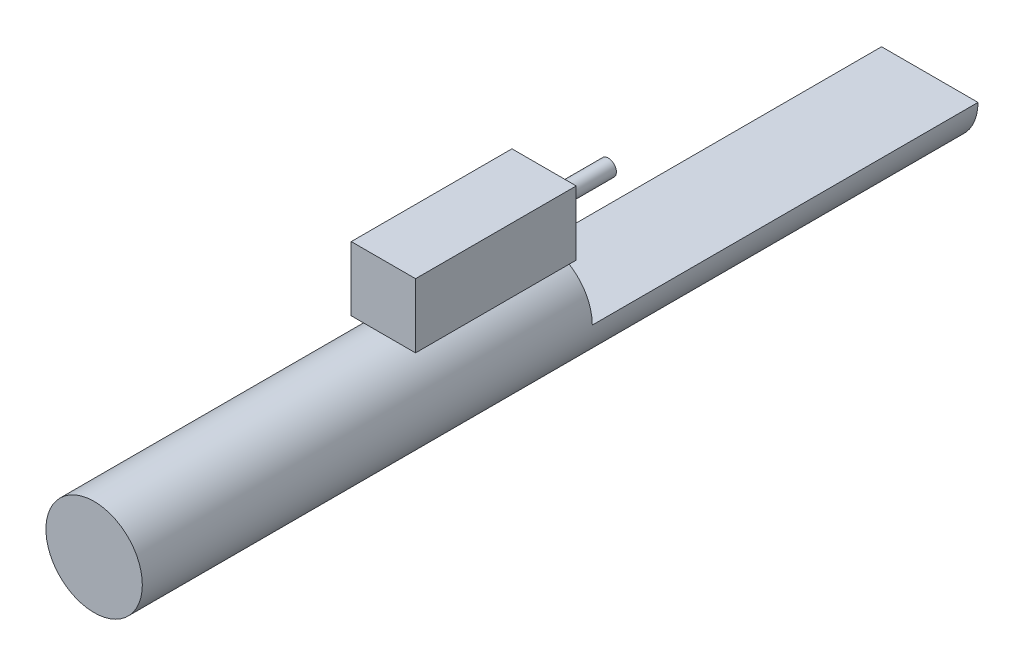
ISO-10303-21;
HEADER;
FILE_DESCRIPTION(('STEP AP214'),'2;1');
FILE_NAME('part.step','',(''),(''),'','','');
FILE_SCHEMA(('AUTOMOTIVE_DESIGN { 1 0 10303 214 1 1 1 1 }'));
ENDSEC;
DATA;
#1=APPLICATION_CONTEXT('core data for automotive mechanical design processes');
#2=APPLICATION_PROTOCOL_DEFINITION('international standard','automotive_design',2000,#1);
#3=PRODUCT_CONTEXT('',#1,'mechanical');
#4=PRODUCT('Part','Part','',(#3));
#5=PRODUCT_RELATED_PRODUCT_CATEGORY('part','',(#4));
#6=PRODUCT_DEFINITION_FORMATION('','',#4);
#7=PRODUCT_DEFINITION_CONTEXT('part definition',#1,'design');
#8=PRODUCT_DEFINITION('design','',#6,#7);
#9=PRODUCT_DEFINITION_SHAPE('','',#8);
#10=(LENGTH_UNIT() NAMED_UNIT(*) SI_UNIT(.MILLI.,.METRE.));
#11=(NAMED_UNIT(*) PLANE_ANGLE_UNIT() SI_UNIT($,.RADIAN.));
#12=(NAMED_UNIT(*) SI_UNIT($,.STERADIAN.) SOLID_ANGLE_UNIT());
#13=UNCERTAINTY_MEASURE_WITH_UNIT(LENGTH_MEASURE(1.E-05),#10,'distance_accuracy_value','');
#14=(GEOMETRIC_REPRESENTATION_CONTEXT(3) GLOBAL_UNCERTAINTY_ASSIGNED_CONTEXT((#13)) GLOBAL_UNIT_ASSIGNED_CONTEXT((#10,
#11,#12)) REPRESENTATION_CONTEXT('',''));
#15=CARTESIAN_POINT('',(0.,0.,0.));
#16=DIRECTION('',(0.,0.,1.));
#17=DIRECTION('',(1.,0.,0.));
#18=AXIS2_PLACEMENT_3D('',#15,#16,#17);
#19=CARTESIAN_POINT('',(-5.,17.5,0.));
#20=DIRECTION('',(1.,0.,0.));
#21=DIRECTION('',(0.,0.,-1.));
#22=AXIS2_PLACEMENT_3D('',#19,#20,#21);
#23=PLANE('',#22);
#24=DIRECTION('',(0.,0.,1.));
#25=VECTOR('',#24,1.);
#26=CARTESIAN_POINT('',(-5.,7.5,0.));
#27=LINE('',#26,#25);
#28=CARTESIAN_POINT('',(-5.,7.5,0.));
#29=VERTEX_POINT('',#28);
#30=CARTESIAN_POINT('',(-5.,7.5,25.));
#31=VERTEX_POINT('',#30);
#32=EDGE_CURVE('E115',#29,#31,#27,.T.);
#33=ORIENTED_EDGE('',*,*,#32,.T.);
#34=DIRECTION('',(0.,-1.,0.));
#35=VECTOR('',#34,1.);
#36=CARTESIAN_POINT('',(-5.,17.5,25.));
#37=LINE('',#36,#35);
#38=CARTESIAN_POINT('',(-5.,17.5,25.));
#39=VERTEX_POINT('',#38);
#40=EDGE_CURVE('E52',#39,#31,#37,.T.);
#41=ORIENTED_EDGE('',*,*,#40,.F.);
#42=DIRECTION('',(0.,0.,1.));
#43=VECTOR('',#42,1.);
#44=CARTESIAN_POINT('',(-5.,17.5,0.));
#45=LINE('',#44,#43);
#46=CARTESIAN_POINT('',(-5.,17.5,0.));
#47=VERTEX_POINT('',#46);
#48=EDGE_CURVE('E102',#47,#39,#45,.T.);
#49=ORIENTED_EDGE('',*,*,#48,.F.);
#50=DIRECTION('',(0.,-1.,0.));
#51=VECTOR('',#50,1.);
#52=CARTESIAN_POINT('',(-5.,17.5,0.));
#53=LINE('',#52,#51);
#54=EDGE_CURVE('E111',#47,#29,#53,.T.);
#55=ORIENTED_EDGE('',*,*,#54,.T.);
#56=EDGE_LOOP('',(#33,#41,#49,#55));
#57=FACE_BOUND('',#56,.T.);
#58=ADVANCED_FACE('F49',(#57),#23,.F.);
#59=CARTESIAN_POINT('',(-5.,17.5,25.));
#60=DIRECTION('',(0.,0.,-1.));
#61=DIRECTION('',(-1.,0.,0.));
#62=AXIS2_PLACEMENT_3D('',#59,#60,#61);
#63=PLANE('',#62);
#64=DIRECTION('',(1.,0.,0.));
#65=VECTOR('',#64,1.);
#66=CARTESIAN_POINT('',(-5.,7.5,25.));
#67=LINE('',#66,#65);
#68=CARTESIAN_POINT('',(5.,7.5,25.));
#69=VERTEX_POINT('',#68);
#70=EDGE_CURVE('E107',#31,#69,#67,.T.);
#71=ORIENTED_EDGE('',*,*,#70,.T.);
#72=DIRECTION('',(0.,-1.,0.));
#73=VECTOR('',#72,1.);
#74=CARTESIAN_POINT('',(5.,17.5,25.));
#75=LINE('',#74,#73);
#76=CARTESIAN_POINT('',(5.,17.5,25.));
#77=VERTEX_POINT('',#76);
#78=EDGE_CURVE('E105',#77,#69,#75,.T.);
#79=ORIENTED_EDGE('',*,*,#78,.F.);
#80=DIRECTION('',(1.,0.,0.));
#81=VECTOR('',#80,1.);
#82=CARTESIAN_POINT('',(-5.,17.5,25.));
#83=LINE('',#82,#81);
#84=EDGE_CURVE('E97',#39,#77,#83,.T.);
#85=ORIENTED_EDGE('',*,*,#84,.F.);
#86=ORIENTED_EDGE('',*,*,#40,.T.);
#87=EDGE_LOOP('',(#71,#79,#85,#86));
#88=FACE_BOUND('',#87,.T.);
#89=ADVANCED_FACE('F106',(#88),#63,.F.);
#90=CARTESIAN_POINT('',(5.,17.5,0.));
#91=DIRECTION('',(-1.,0.,0.));
#92=DIRECTION('',(0.,0.,1.));
#93=AXIS2_PLACEMENT_3D('',#90,#91,#92);
#94=PLANE('',#93);
#95=DIRECTION('',(0.,0.,-1.));
#96=VECTOR('',#95,1.);
#97=CARTESIAN_POINT('',(5.,7.5,0.));
#98=LINE('',#97,#96);
#99=CARTESIAN_POINT('',(5.,7.5,0.));
#100=VERTEX_POINT('',#99);
#101=EDGE_CURVE('E83',#69,#100,#98,.T.);
#102=ORIENTED_EDGE('',*,*,#101,.T.);
#103=DIRECTION('',(0.,-1.,0.));
#104=VECTOR('',#103,1.);
#105=CARTESIAN_POINT('',(5.,17.5,0.));
#106=LINE('',#105,#104);
#107=CARTESIAN_POINT('',(5.,17.5,0.));
#108=VERTEX_POINT('',#107);
#109=EDGE_CURVE('E108',#108,#100,#106,.T.);
#110=ORIENTED_EDGE('',*,*,#109,.F.);
#111=DIRECTION('',(0.,0.,-1.));
#112=VECTOR('',#111,1.);
#113=CARTESIAN_POINT('',(5.,17.5,0.));
#114=LINE('',#113,#112);
#115=EDGE_CURVE('E100',#77,#108,#114,.T.);
#116=ORIENTED_EDGE('',*,*,#115,.F.);
#117=ORIENTED_EDGE('',*,*,#78,.T.);
#118=EDGE_LOOP('',(#102,#110,#116,#117));
#119=FACE_BOUND('',#118,.T.);
#120=ADVANCED_FACE('F109',(#119),#94,.F.);
#121=CARTESIAN_POINT('',(-5.,17.5,0.));
#122=DIRECTION('',(0.,0.,1.));
#123=DIRECTION('',(1.,0.,0.));
#124=AXIS2_PLACEMENT_3D('',#121,#122,#123);
#125=PLANE('',#124);
#126=CARTESIAN_POINT('',(0.,12.5,0.));
#127=DIRECTION('',(0.,0.,-1.));
#128=DIRECTION('',(-1.,0.,0.));
#129=AXIS2_PLACEMENT_3D('',#126,#127,#128);
#130=CIRCLE('',#129,1.25);
#131=CARTESIAN_POINT('',(-1.25,12.5,0.));
#132=VERTEX_POINT('',#131);
#133=EDGE_CURVE('E12',#132,#132,#130,.T.);
#134=ORIENTED_EDGE('',*,*,#133,.F.);
#135=EDGE_LOOP('',(#134));
#136=FACE_BOUND('',#135,.T.);
#137=DIRECTION('',(-1.,0.,0.));
#138=VECTOR('',#137,1.);
#139=CARTESIAN_POINT('',(-5.,7.5,0.));
#140=LINE('',#139,#138);
#141=EDGE_CURVE('E89',#100,#29,#140,.T.);
#142=ORIENTED_EDGE('',*,*,#141,.T.);
#143=ORIENTED_EDGE('',*,*,#54,.F.);
#144=DIRECTION('',(-1.,0.,0.));
#145=VECTOR('',#144,1.);
#146=CARTESIAN_POINT('',(-5.,17.5,0.));
#147=LINE('',#146,#145);
#148=EDGE_CURVE('E66',#108,#47,#147,.T.);
#149=ORIENTED_EDGE('',*,*,#148,.F.);
#150=ORIENTED_EDGE('',*,*,#109,.T.);
#151=EDGE_LOOP('',(#142,#143,#149,#150));
#152=FACE_BOUND('',#151,.T.);
#153=ADVANCED_FACE('F123',(#136,#152),#125,.F.);
#154=CARTESIAN_POINT('',(0.,17.5,0.));
#155=DIRECTION('',(0.,1.,0.));
#156=DIRECTION('',(0.,0.,1.));
#157=AXIS2_PLACEMENT_3D('',#154,#155,#156);
#158=PLANE('',#157);
#159=ORIENTED_EDGE('',*,*,#48,.T.);
#160=ORIENTED_EDGE('',*,*,#84,.T.);
#161=ORIENTED_EDGE('',*,*,#115,.T.);
#162=ORIENTED_EDGE('',*,*,#148,.T.);
#163=EDGE_LOOP('',(#159,#160,#161,#162));
#164=FACE_BOUND('',#163,.T.);
#165=ADVANCED_FACE('F98',(#164),#158,.T.);
#166=CARTESIAN_POINT('',(0.,7.5,0.));
#167=DIRECTION('',(0.,1.,0.));
#168=DIRECTION('',(0.,0.,1.));
#169=AXIS2_PLACEMENT_3D('',#166,#167,#168);
#170=PLANE('',#169);
#171=ORIENTED_EDGE('',*,*,#32,.F.);
#172=ORIENTED_EDGE('',*,*,#141,.F.);
#173=ORIENTED_EDGE('',*,*,#101,.F.);
#174=ORIENTED_EDGE('',*,*,#70,.F.);
#175=EDGE_LOOP('',(#171,#172,#173,#174));
#176=FACE_BOUND('',#175,.T.);
#177=ADVANCED_FACE('F126',(#176),#170,.F.);
#178=CARTESIAN_POINT('',(0.,12.5,-10.));
#179=DIRECTION('',(0.,0.,1.));
#180=DIRECTION('',(1.,0.,0.));
#181=AXIS2_PLACEMENT_3D('',#178,#179,#180);
#182=CYLINDRICAL_SURFACE('',#181,1.25);
#183=CARTESIAN_POINT('',(0.,12.5,-10.));
#184=DIRECTION('',(0.,0.,-1.));
#185=DIRECTION('',(-1.,0.,0.));
#186=AXIS2_PLACEMENT_3D('',#183,#184,#185);
#187=CIRCLE('',#186,1.25);
#188=CARTESIAN_POINT('',(-1.25,12.5,-10.));
#189=VERTEX_POINT('',#188);
#190=EDGE_CURVE('E118',#189,#189,#187,.T.);
#191=ORIENTED_EDGE('',*,*,#190,.F.);
#192=EDGE_LOOP('',(#191));
#193=FACE_BOUND('',#192,.T.);
#194=ORIENTED_EDGE('',*,*,#133,.T.);
#195=EDGE_LOOP('',(#194));
#196=FACE_BOUND('',#195,.T.);
#197=ADVANCED_FACE('F134',(#193,#196),#182,.T.);
#198=CARTESIAN_POINT('',(0.,12.5,-10.));
#199=DIRECTION('',(0.,0.,-1.));
#200=DIRECTION('',(-1.,0.,0.));
#201=AXIS2_PLACEMENT_3D('',#198,#199,#200);
#202=PLANE('',#201);
#203=ORIENTED_EDGE('',*,*,#190,.T.);
#204=EDGE_LOOP('',(#203));
#205=FACE_BOUND('',#204,.T.);
#206=ADVANCED_FACE('F132',(#205),#202,.T.);
#207=CLOSED_SHELL('',(#58,#89,#120,#153,#165,#177,#197,#206));
#208=MANIFOLD_SOLID_BREP('B2',#207);
#209=CARTESIAN_POINT('',(0.,0.,0.));
#210=DIRECTION('',(0.,0.,1.));
#211=DIRECTION('',(1.,0.,0.));
#212=AXIS2_PLACEMENT_3D('',#209,#210,#211);
#213=PLANE('',#212);
#214=DIRECTION('',(1.,0.,0.));
#215=VECTOR('',#214,1.);
#216=CARTESIAN_POINT('',(7.5,0.,0.));
#217=LINE('',#216,#215);
#218=CARTESIAN_POINT('',(-7.5,0.,0.));
#219=VERTEX_POINT('',#218);
#220=CARTESIAN_POINT('',(7.5,0.,0.));
#221=VERTEX_POINT('',#220);
#222=EDGE_CURVE('E217',#219,#221,#217,.T.);
#223=ORIENTED_EDGE('',*,*,#222,.F.);
#224=CARTESIAN_POINT('',(0.,0.,0.));
#225=DIRECTION('',(0.,0.,1.));
#226=DIRECTION('',(1.,0.,0.));
#227=AXIS2_PLACEMENT_3D('',#224,#225,#226);
#228=CIRCLE('',#227,7.5);
#229=EDGE_CURVE('E206',#221,#219,#228,.T.);
#230=ORIENTED_EDGE('',*,*,#229,.F.);
#231=EDGE_LOOP('',(#223,#230));
#232=FACE_BOUND('',#231,.T.);
#233=ADVANCED_FACE('F202',(#232),#213,.F.);
#234=CARTESIAN_POINT('',(0.,0.,70.));
#235=DIRECTION('',(0.,0.,-1.));
#236=DIRECTION('',(-1.,0.,0.));
#237=AXIS2_PLACEMENT_3D('',#234,#235,#236);
#238=CYLINDRICAL_SURFACE('',#237,7.5);
#239=CARTESIAN_POINT('',(0.,0.,70.));
#240=DIRECTION('',(0.,0.,1.));
#241=DIRECTION('',(1.,0.,0.));
#242=AXIS2_PLACEMENT_3D('',#239,#240,#241);
#243=CIRCLE('',#242,7.5);
#244=CARTESIAN_POINT('',(7.5,0.,70.));
#245=VERTEX_POINT('',#244);
#246=EDGE_CURVE('E47',#245,#245,#243,.T.);
#247=ORIENTED_EDGE('',*,*,#246,.F.);
#248=EDGE_LOOP('',(#247));
#249=FACE_BOUND('',#248,.T.);
#250=ORIENTED_EDGE('',*,*,#229,.T.);
#251=DIRECTION('',(0.,0.,1.));
#252=VECTOR('',#251,1.);
#253=CARTESIAN_POINT('',(-7.5,0.,-60.));
#254=LINE('',#253,#252);
#255=CARTESIAN_POINT('',(-7.5,0.,-60.));
#256=VERTEX_POINT('',#255);
#257=EDGE_CURVE('E234',#256,#219,#254,.T.);
#258=ORIENTED_EDGE('',*,*,#257,.F.);
#259=CARTESIAN_POINT('',(0.,0.,-60.));
#260=DIRECTION('',(0.,0.,-1.));
#261=DIRECTION('',(-1.,0.,0.));
#262=AXIS2_PLACEMENT_3D('',#259,#260,#261);
#263=CIRCLE('',#262,7.5);
#264=CARTESIAN_POINT('',(7.5,0.,-60.));
#265=VERTEX_POINT('',#264);
#266=EDGE_CURVE('E240',#265,#256,#263,.T.);
#267=ORIENTED_EDGE('',*,*,#266,.F.);
#268=DIRECTION('',(0.,0.,1.));
#269=VECTOR('',#268,1.);
#270=CARTESIAN_POINT('',(7.5,0.,-60.));
#271=LINE('',#270,#269);
#272=EDGE_CURVE('E237',#265,#221,#271,.T.);
#273=ORIENTED_EDGE('',*,*,#272,.T.);
#274=EDGE_LOOP('',(#250,#258,#267,#273));
#275=FACE_BOUND('',#274,.T.);
#276=ADVANCED_FACE('F204',(#249,#275),#238,.T.);
#277=CARTESIAN_POINT('',(0.,0.,70.));
#278=DIRECTION('',(0.,0.,1.));
#279=DIRECTION('',(1.,0.,0.));
#280=AXIS2_PLACEMENT_3D('',#277,#278,#279);
#281=PLANE('',#280);
#282=ORIENTED_EDGE('',*,*,#246,.T.);
#283=EDGE_LOOP('',(#282));
#284=FACE_BOUND('',#283,.T.);
#285=ADVANCED_FACE('F256',(#284),#281,.T.);
#286=CARTESIAN_POINT('',(7.5,0.,-60.));
#287=DIRECTION('',(0.,-1.,0.));
#288=DIRECTION('',(0.,0.,-1.));
#289=AXIS2_PLACEMENT_3D('',#286,#287,#288);
#290=PLANE('',#289);
#291=ORIENTED_EDGE('',*,*,#222,.T.);
#292=ORIENTED_EDGE('',*,*,#272,.F.);
#293=DIRECTION('',(1.,0.,0.));
#294=VECTOR('',#293,1.);
#295=CARTESIAN_POINT('',(7.5,0.,-60.));
#296=LINE('',#295,#294);
#297=EDGE_CURVE('E225',#256,#265,#296,.T.);
#298=ORIENTED_EDGE('',*,*,#297,.F.);
#299=ORIENTED_EDGE('',*,*,#257,.T.);
#300=EDGE_LOOP('',(#291,#292,#298,#299));
#301=FACE_BOUND('',#300,.T.);
#302=ADVANCED_FACE('F236',(#301),#290,.F.);
#303=CARTESIAN_POINT('',(0.,0.,-60.));
#304=DIRECTION('',(0.,0.,-1.));
#305=DIRECTION('',(-1.,0.,0.));
#306=AXIS2_PLACEMENT_3D('',#303,#304,#305);
#307=PLANE('',#306);
#308=ORIENTED_EDGE('',*,*,#266,.T.);
#309=ORIENTED_EDGE('',*,*,#297,.T.);
#310=EDGE_LOOP('',(#308,#309));
#311=FACE_BOUND('',#310,.T.);
#312=ADVANCED_FACE('F250',(#311),#307,.T.);
#313=CLOSED_SHELL('',(#233,#276,#285,#302,#312));
#314=MANIFOLD_SOLID_BREP('B6',#313);
#315=ADVANCED_BREP_SHAPE_REPRESENTATION('',(#18,#208,#314),#14);
#316=SHAPE_DEFINITION_REPRESENTATION(#9,#315);
ENDSEC;
END-ISO-10303-21;
